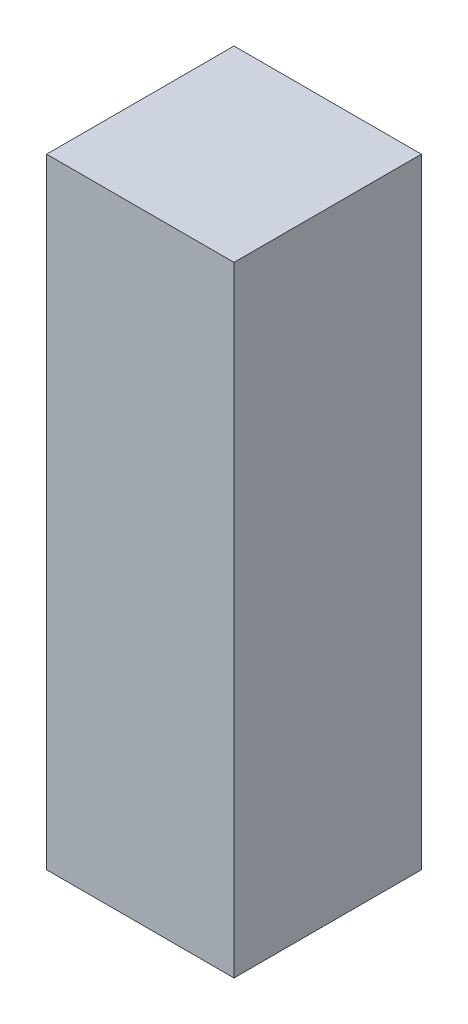
ISO-10303-21;
HEADER;
FILE_DESCRIPTION(('STEP AP214'),'2;1');
FILE_NAME('part.step','',(''),(''),'','','');
FILE_SCHEMA(('AUTOMOTIVE_DESIGN { 1 0 10303 214 1 1 1 1 }'));
ENDSEC;
DATA;
#1=APPLICATION_CONTEXT('core data for automotive mechanical design processes');
#2=APPLICATION_PROTOCOL_DEFINITION('international standard','automotive_design',2000,#1);
#3=PRODUCT_CONTEXT('',#1,'mechanical');
#4=PRODUCT('Part','Part','',(#3));
#5=PRODUCT_RELATED_PRODUCT_CATEGORY('part','',(#4));
#6=PRODUCT_DEFINITION_FORMATION('','',#4);
#7=PRODUCT_DEFINITION_CONTEXT('part definition',#1,'design');
#8=PRODUCT_DEFINITION('design','',#6,#7);
#9=PRODUCT_DEFINITION_SHAPE('','',#8);
#10=(LENGTH_UNIT() NAMED_UNIT(*) SI_UNIT(.MILLI.,.METRE.));
#11=(NAMED_UNIT(*) PLANE_ANGLE_UNIT() SI_UNIT($,.RADIAN.));
#12=(NAMED_UNIT(*) SI_UNIT($,.STERADIAN.) SOLID_ANGLE_UNIT());
#13=UNCERTAINTY_MEASURE_WITH_UNIT(LENGTH_MEASURE(1.E-05),#10,'distance_accuracy_value','');
#14=(GEOMETRIC_REPRESENTATION_CONTEXT(3) GLOBAL_UNCERTAINTY_ASSIGNED_CONTEXT((#13)) GLOBAL_UNIT_ASSIGNED_CONTEXT((#10,
#11,#12)) REPRESENTATION_CONTEXT('',''));
#15=CARTESIAN_POINT('',(0.,0.,0.));
#16=DIRECTION('',(0.,0.,1.));
#17=DIRECTION('',(1.,0.,0.));
#18=AXIS2_PLACEMENT_3D('',#15,#16,#17);
#19=CARTESIAN_POINT('',(-17.8086509766685,7.87371134020619,13.));
#20=DIRECTION('',(1.,0.,0.));
#21=DIRECTION('',(0.,1.,0.));
#22=AXIS2_PLACEMENT_3D('',#19,#20,#21);
#23=PLANE('',#22);
#24=DIRECTION('',(0.,-1.,0.));
#25=VECTOR('',#24,1.);
#26=CARTESIAN_POINT('',(-17.8086509766685,7.87371134020619,0.));
#27=LINE('',#26,#25);
#28=CARTESIAN_POINT('',(-17.8086509766685,7.87371134020619,0.));
#29=VERTEX_POINT('',#28);
#30=CARTESIAN_POINT('',(-17.8086509766685,-35.1262886597938,0.));
#31=VERTEX_POINT('',#30);
#32=EDGE_CURVE('E96',#29,#31,#27,.T.);
#33=ORIENTED_EDGE('',*,*,#32,.T.);
#34=DIRECTION('',(0.,0.,-1.));
#35=VECTOR('',#34,1.);
#36=CARTESIAN_POINT('',(-17.8086509766685,-35.1262886597938,13.));
#37=LINE('',#36,#35);
#38=CARTESIAN_POINT('',(-17.8086509766685,-35.1262886597938,13.));
#39=VERTEX_POINT('',#38);
#40=EDGE_CURVE('E11',#39,#31,#37,.T.);
#41=ORIENTED_EDGE('',*,*,#40,.F.);
#42=DIRECTION('',(0.,-1.,0.));
#43=VECTOR('',#42,1.);
#44=CARTESIAN_POINT('',(-17.8086509766685,7.87371134020619,13.));
#45=LINE('',#44,#43);
#46=CARTESIAN_POINT('',(-17.8086509766685,7.87371134020619,13.));
#47=VERTEX_POINT('',#46);
#48=EDGE_CURVE('E84',#47,#39,#45,.T.);
#49=ORIENTED_EDGE('',*,*,#48,.F.);
#50=DIRECTION('',(0.,0.,-1.));
#51=VECTOR('',#50,1.);
#52=CARTESIAN_POINT('',(-17.8086509766685,7.87371134020619,13.));
#53=LINE('',#52,#51);
#54=EDGE_CURVE('E92',#47,#29,#53,.T.);
#55=ORIENTED_EDGE('',*,*,#54,.T.);
#56=EDGE_LOOP('',(#33,#41,#49,#55));
#57=FACE_BOUND('',#56,.T.);
#58=ADVANCED_FACE('F33',(#57),#23,.F.);
#59=CARTESIAN_POINT('',(-17.8086509766685,-35.1262886597938,13.));
#60=DIRECTION('',(0.,1.,0.));
#61=DIRECTION('',(0.,0.,1.));
#62=AXIS2_PLACEMENT_3D('',#59,#60,#61);
#63=PLANE('',#62);
#64=DIRECTION('',(1.,0.,0.));
#65=VECTOR('',#64,1.);
#66=CARTESIAN_POINT('',(-17.8086509766685,-35.1262886597938,0.));
#67=LINE('',#66,#65);
#68=CARTESIAN_POINT('',(-4.80865097666848,-35.1262886597938,0.));
#69=VERTEX_POINT('',#68);
#70=EDGE_CURVE('E88',#31,#69,#67,.T.);
#71=ORIENTED_EDGE('',*,*,#70,.T.);
#72=DIRECTION('',(0.,0.,-1.));
#73=VECTOR('',#72,1.);
#74=CARTESIAN_POINT('',(-4.80865097666848,-35.1262886597938,13.));
#75=LINE('',#74,#73);
#76=CARTESIAN_POINT('',(-4.80865097666848,-35.1262886597938,13.));
#77=VERTEX_POINT('',#76);
#78=EDGE_CURVE('E41',#77,#69,#75,.T.);
#79=ORIENTED_EDGE('',*,*,#78,.F.);
#80=DIRECTION('',(1.,0.,0.));
#81=VECTOR('',#80,1.);
#82=CARTESIAN_POINT('',(-17.8086509766685,-35.1262886597938,13.));
#83=LINE('',#82,#81);
#84=EDGE_CURVE('E79',#39,#77,#83,.T.);
#85=ORIENTED_EDGE('',*,*,#84,.F.);
#86=ORIENTED_EDGE('',*,*,#40,.T.);
#87=EDGE_LOOP('',(#71,#79,#85,#86));
#88=FACE_BOUND('',#87,.T.);
#89=ADVANCED_FACE('F87',(#88),#63,.F.);
#90=CARTESIAN_POINT('',(-4.80865097666848,7.87371134020619,13.));
#91=DIRECTION('',(-1.,0.,0.));
#92=DIRECTION('',(0.,-1.,0.));
#93=AXIS2_PLACEMENT_3D('',#90,#91,#92);
#94=PLANE('',#93);
#95=DIRECTION('',(0.,1.,0.));
#96=VECTOR('',#95,1.);
#97=CARTESIAN_POINT('',(-4.80865097666848,7.87371134020619,0.));
#98=LINE('',#97,#96);
#99=CARTESIAN_POINT('',(-4.80865097666848,7.87371134020619,0.));
#100=VERTEX_POINT('',#99);
#101=EDGE_CURVE('E66',#69,#100,#98,.T.);
#102=ORIENTED_EDGE('',*,*,#101,.T.);
#103=DIRECTION('',(0.,0.,-1.));
#104=VECTOR('',#103,1.);
#105=CARTESIAN_POINT('',(-4.80865097666848,7.87371134020619,13.));
#106=LINE('',#105,#104);
#107=CARTESIAN_POINT('',(-4.80865097666848,7.87371134020619,13.));
#108=VERTEX_POINT('',#107);
#109=EDGE_CURVE('E89',#108,#100,#106,.T.);
#110=ORIENTED_EDGE('',*,*,#109,.F.);
#111=DIRECTION('',(0.,1.,0.));
#112=VECTOR('',#111,1.);
#113=CARTESIAN_POINT('',(-4.80865097666848,7.87371134020619,13.));
#114=LINE('',#113,#112);
#115=EDGE_CURVE('E82',#77,#108,#114,.T.);
#116=ORIENTED_EDGE('',*,*,#115,.F.);
#117=ORIENTED_EDGE('',*,*,#78,.T.);
#118=EDGE_LOOP('',(#102,#110,#116,#117));
#119=FACE_BOUND('',#118,.T.);
#120=ADVANCED_FACE('F90',(#119),#94,.F.);
#121=CARTESIAN_POINT('',(-17.8086509766685,7.87371134020619,13.));
#122=DIRECTION('',(0.,-1.,0.));
#123=DIRECTION('',(0.,0.,-1.));
#124=AXIS2_PLACEMENT_3D('',#121,#122,#123);
#125=PLANE('',#124);
#126=DIRECTION('',(-1.,0.,0.));
#127=VECTOR('',#126,1.);
#128=CARTESIAN_POINT('',(-17.8086509766685,7.87371134020619,0.));
#129=LINE('',#128,#127);
#130=EDGE_CURVE('E72',#100,#29,#129,.T.);
#131=ORIENTED_EDGE('',*,*,#130,.T.);
#132=ORIENTED_EDGE('',*,*,#54,.F.);
#133=DIRECTION('',(-1.,0.,0.));
#134=VECTOR('',#133,1.);
#135=CARTESIAN_POINT('',(-17.8086509766685,7.87371134020619,13.));
#136=LINE('',#135,#134);
#137=EDGE_CURVE('E49',#108,#47,#136,.T.);
#138=ORIENTED_EDGE('',*,*,#137,.F.);
#139=ORIENTED_EDGE('',*,*,#109,.T.);
#140=EDGE_LOOP('',(#131,#132,#138,#139));
#141=FACE_BOUND('',#140,.T.);
#142=ADVANCED_FACE('F103',(#141),#125,.F.);
#143=CARTESIAN_POINT('',(0.,0.,13.));
#144=DIRECTION('',(0.,0.,1.));
#145=DIRECTION('',(1.,0.,0.));
#146=AXIS2_PLACEMENT_3D('',#143,#144,#145);
#147=PLANE('',#146);
#148=ORIENTED_EDGE('',*,*,#48,.T.);
#149=ORIENTED_EDGE('',*,*,#84,.T.);
#150=ORIENTED_EDGE('',*,*,#115,.T.);
#151=ORIENTED_EDGE('',*,*,#137,.T.);
#152=EDGE_LOOP('',(#148,#149,#150,#151));
#153=FACE_BOUND('',#152,.T.);
#154=ADVANCED_FACE('F80',(#153),#147,.T.);
#155=CARTESIAN_POINT('',(0.,0.,0.));
#156=DIRECTION('',(0.,0.,1.));
#157=DIRECTION('',(1.,0.,0.));
#158=AXIS2_PLACEMENT_3D('',#155,#156,#157);
#159=PLANE('',#158);
#160=ORIENTED_EDGE('',*,*,#32,.F.);
#161=ORIENTED_EDGE('',*,*,#130,.F.);
#162=ORIENTED_EDGE('',*,*,#101,.F.);
#163=ORIENTED_EDGE('',*,*,#70,.F.);
#164=EDGE_LOOP('',(#160,#161,#162,#163));
#165=FACE_BOUND('',#164,.T.);
#166=ADVANCED_FACE('F106',(#165),#159,.F.);
#167=CLOSED_SHELL('',(#58,#89,#120,#142,#154,#166));
#168=MANIFOLD_SOLID_BREP('B2',#167);
#169=ADVANCED_BREP_SHAPE_REPRESENTATION('',(#18,#168),#14);
#170=SHAPE_DEFINITION_REPRESENTATION(#9,#169);
ENDSEC;
END-ISO-10303-21;
